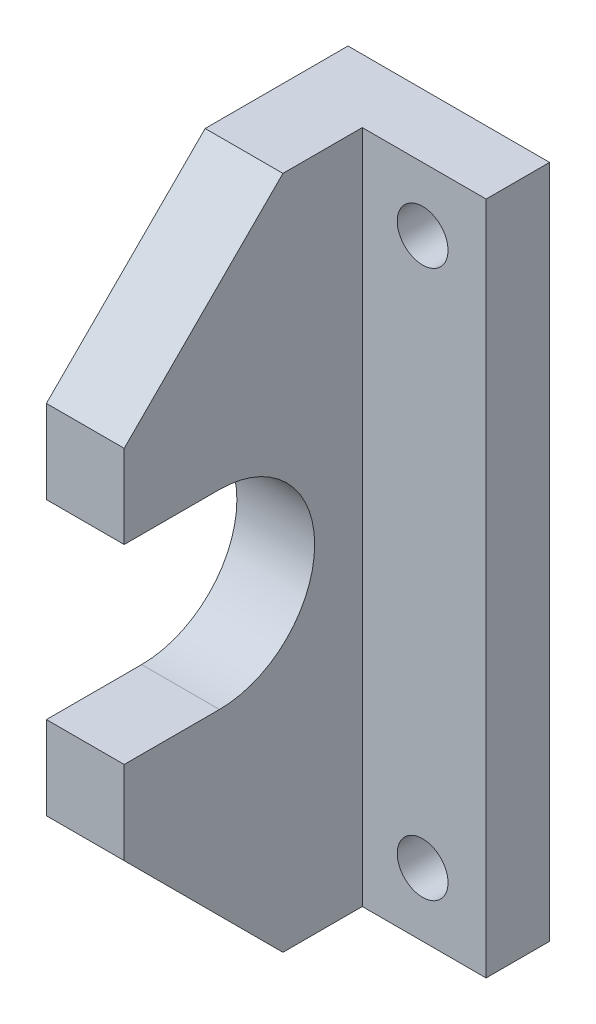
ISO-10303-21;
HEADER;
FILE_DESCRIPTION(('STEP AP214'),'2;1');
FILE_NAME('part.step','',(''),(''),'','','');
FILE_SCHEMA(('AUTOMOTIVE_DESIGN { 1 0 10303 214 1 1 1 1 }'));
ENDSEC;
DATA;
#1=APPLICATION_CONTEXT('core data for automotive mechanical design processes');
#2=APPLICATION_PROTOCOL_DEFINITION('international standard','automotive_design',2000,#1);
#3=PRODUCT_CONTEXT('',#1,'mechanical');
#4=PRODUCT('Part','Part','',(#3));
#5=PRODUCT_RELATED_PRODUCT_CATEGORY('part','',(#4));
#6=PRODUCT_DEFINITION_FORMATION('','',#4);
#7=PRODUCT_DEFINITION_CONTEXT('part definition',#1,'design');
#8=PRODUCT_DEFINITION('design','',#6,#7);
#9=PRODUCT_DEFINITION_SHAPE('','',#8);
#10=(LENGTH_UNIT() NAMED_UNIT(*) SI_UNIT(.MILLI.,.METRE.));
#11=(NAMED_UNIT(*) PLANE_ANGLE_UNIT() SI_UNIT($,.RADIAN.));
#12=(NAMED_UNIT(*) SI_UNIT($,.STERADIAN.) SOLID_ANGLE_UNIT());
#13=UNCERTAINTY_MEASURE_WITH_UNIT(LENGTH_MEASURE(1.E-05),#10,'distance_accuracy_value','');
#14=(GEOMETRIC_REPRESENTATION_CONTEXT(3) GLOBAL_UNCERTAINTY_ASSIGNED_CONTEXT((#13)) GLOBAL_UNIT_ASSIGNED_CONTEXT((#10,
#11,#12)) REPRESENTATION_CONTEXT('',''));
#15=CARTESIAN_POINT('',(0.,0.,0.));
#16=DIRECTION('',(0.,0.,1.));
#17=DIRECTION('',(1.,0.,0.));
#18=AXIS2_PLACEMENT_3D('',#15,#16,#17);
#19=CARTESIAN_POINT('',(0.,0.,19.));
#20=DIRECTION('',(0.,0.,1.));
#21=DIRECTION('',(1.,0.,0.));
#22=AXIS2_PLACEMENT_3D('',#19,#20,#21);
#23=PLANE('',#22);
#24=DIRECTION('',(0.,-1.,0.));
#25=VECTOR('',#24,1.);
#26=CARTESIAN_POINT('',(25.9154898415816,42.4999999977286,19.));
#27=LINE('',#26,#25);
#28=CARTESIAN_POINT('',(25.9154898415816,15.2500004309608,19.));
#29=VERTEX_POINT('',#28);
#30=CARTESIAN_POINT('',(25.9154898415816,9.99999999772865,19.));
#31=VERTEX_POINT('',#30);
#32=EDGE_CURVE('E169',#29,#31,#27,.T.);
#33=ORIENTED_EDGE('',*,*,#32,.T.);
#34=DIRECTION('',(1.,0.,0.));
#35=VECTOR('',#34,1.);
#36=CARTESIAN_POINT('',(30.8154898415816,9.99999999772864,19.));
#37=LINE('',#36,#35);
#38=CARTESIAN_POINT('',(30.8154898415816,9.99999999772866,19.));
#39=VERTEX_POINT('',#38);
#40=EDGE_CURVE('E45',#31,#39,#37,.T.);
#41=ORIENTED_EDGE('',*,*,#40,.T.);
#42=DIRECTION('',(0.,1.,0.));
#43=VECTOR('',#42,1.);
#44=CARTESIAN_POINT('',(30.8154898415816,42.4999999977286,19.));
#45=LINE('',#44,#43);
#46=CARTESIAN_POINT('',(30.8154898415816,15.2500004309608,19.));
#47=VERTEX_POINT('',#46);
#48=EDGE_CURVE('E170',#39,#47,#45,.T.);
#49=ORIENTED_EDGE('',*,*,#48,.T.);
#50=DIRECTION('',(1.,0.,0.));
#51=VECTOR('',#50,1.);
#52=CARTESIAN_POINT('',(25.9154898415816,15.2500004309608,19.));
#53=LINE('',#52,#51);
#54=EDGE_CURVE('E162',#29,#47,#53,.T.);
#55=ORIENTED_EDGE('',*,*,#54,.F.);
#56=EDGE_LOOP('',(#33,#41,#49,#55));
#57=FACE_BOUND('',#56,.T.);
#58=ADVANCED_FACE('F37',(#57),#23,.T.);
#59=CARTESIAN_POINT('',(0.,0.,4.));
#60=DIRECTION('',(0.,0.,-1.));
#61=DIRECTION('',(-1.,0.,0.));
#62=AXIS2_PLACEMENT_3D('',#59,#60,#61);
#63=PLANE('',#62);
#64=CARTESIAN_POINT('',(34.6154898415816,38.4999999977286,4.));
#65=DIRECTION('',(0.,0.,1.));
#66=DIRECTION('',(1.,0.,0.));
#67=AXIS2_PLACEMENT_3D('',#64,#65,#66);
#68=CIRCLE('',#67,1.6);
#69=CARTESIAN_POINT('',(36.2154898415816,38.4999999977286,4.));
#70=VERTEX_POINT('',#69);
#71=EDGE_CURVE('E175',#70,#70,#68,.T.);
#72=ORIENTED_EDGE('',*,*,#71,.F.);
#73=EDGE_LOOP('',(#72));
#74=FACE_BOUND('',#73,.T.);
#75=CARTESIAN_POINT('',(34.6154898415816,3.99999999772863,4.));
#76=DIRECTION('',(0.,0.,1.));
#77=DIRECTION('',(1.,0.,0.));
#78=AXIS2_PLACEMENT_3D('',#75,#76,#77);
#79=CIRCLE('',#78,1.6);
#80=CARTESIAN_POINT('',(36.2154898415816,3.99999999772863,4.));
#81=VERTEX_POINT('',#80);
#82=EDGE_CURVE('E242',#81,#81,#79,.T.);
#83=ORIENTED_EDGE('',*,*,#82,.F.);
#84=EDGE_LOOP('',(#83));
#85=FACE_BOUND('',#84,.T.);
#86=DIRECTION('',(0.,1.,0.));
#87=VECTOR('',#86,1.);
#88=CARTESIAN_POINT('',(30.8154898415816,42.4999999977286,4.));
#89=LINE('',#88,#87);
#90=CARTESIAN_POINT('',(30.8154898415816,-2.2713671249749E-09,4.));
#91=VERTEX_POINT('',#90);
#92=CARTESIAN_POINT('',(30.8154898415816,42.4999999977286,4.));
#93=VERTEX_POINT('',#92);
#94=EDGE_CURVE('E161',#91,#93,#89,.T.);
#95=ORIENTED_EDGE('',*,*,#94,.F.);
#96=DIRECTION('',(1.,0.,0.));
#97=VECTOR('',#96,1.);
#98=CARTESIAN_POINT('',(38.6154898415816,-2.2713671249749E-09,4.));
#99=LINE('',#98,#97);
#100=CARTESIAN_POINT('',(38.6154898415816,-2.2713671249749E-09,4.));
#101=VERTEX_POINT('',#100);
#102=EDGE_CURVE('E182',#91,#101,#99,.T.);
#103=ORIENTED_EDGE('',*,*,#102,.T.);
#104=DIRECTION('',(0.,1.,0.));
#105=VECTOR('',#104,1.);
#106=CARTESIAN_POINT('',(38.6154898415816,42.4999999977286,4.));
#107=LINE('',#106,#105);
#108=CARTESIAN_POINT('',(38.6154898415816,42.4999999977286,4.));
#109=VERTEX_POINT('',#108);
#110=EDGE_CURVE('E233',#101,#109,#107,.T.);
#111=ORIENTED_EDGE('',*,*,#110,.T.);
#112=DIRECTION('',(-1.,0.,0.));
#113=VECTOR('',#112,1.);
#114=CARTESIAN_POINT('',(38.6154898415816,42.4999999977286,4.));
#115=LINE('',#114,#113);
#116=EDGE_CURVE('E230',#109,#93,#115,.T.);
#117=ORIENTED_EDGE('',*,*,#116,.T.);
#118=EDGE_LOOP('',(#95,#103,#111,#117));
#119=FACE_BOUND('',#118,.T.);
#120=ADVANCED_FACE('F296',(#74,#85,#119),#63,.F.);
#121=CARTESIAN_POINT('',(0.,0.,0.));
#122=DIRECTION('',(0.,0.,-1.));
#123=DIRECTION('',(-1.,0.,0.));
#124=AXIS2_PLACEMENT_3D('',#121,#122,#123);
#125=PLANE('',#124);
#126=CARTESIAN_POINT('',(34.6154898415816,3.99999999772863,0.));
#127=DIRECTION('',(0.,0.,1.));
#128=DIRECTION('',(1.,0.,0.));
#129=AXIS2_PLACEMENT_3D('',#126,#127,#128);
#130=CIRCLE('',#129,1.6);
#131=CARTESIAN_POINT('',(36.2154898415816,3.99999999772863,0.));
#132=VERTEX_POINT('',#131);
#133=EDGE_CURVE('E272',#132,#132,#130,.T.);
#134=ORIENTED_EDGE('',*,*,#133,.T.);
#135=EDGE_LOOP('',(#134));
#136=FACE_BOUND('',#135,.T.);
#137=DIRECTION('',(0.,1.,0.));
#138=VECTOR('',#137,1.);
#139=CARTESIAN_POINT('',(38.6154898415816,42.4999999977286,0.));
#140=LINE('',#139,#138);
#141=CARTESIAN_POINT('',(38.6154898415816,-2.2713671249749E-09,0.));
#142=VERTEX_POINT('',#141);
#143=CARTESIAN_POINT('',(38.6154898415816,42.4999999977286,0.));
#144=VERTEX_POINT('',#143);
#145=EDGE_CURVE('E239',#142,#144,#140,.T.);
#146=ORIENTED_EDGE('',*,*,#145,.F.);
#147=DIRECTION('',(1.,0.,0.));
#148=VECTOR('',#147,1.);
#149=CARTESIAN_POINT('',(38.6154898415816,-2.2713671249749E-09,0.));
#150=LINE('',#149,#148);
#151=CARTESIAN_POINT('',(25.9154898415816,-2.2713671249749E-09,0.));
#152=VERTEX_POINT('',#151);
#153=EDGE_CURVE('E247',#152,#142,#150,.T.);
#154=ORIENTED_EDGE('',*,*,#153,.F.);
#155=DIRECTION('',(0.,-1.,0.));
#156=VECTOR('',#155,1.);
#157=CARTESIAN_POINT('',(25.9154898415816,42.4999999977286,0.));
#158=LINE('',#157,#156);
#159=CARTESIAN_POINT('',(25.9154898415816,42.4999999977286,0.));
#160=VERTEX_POINT('',#159);
#161=EDGE_CURVE('E244',#160,#152,#158,.T.);
#162=ORIENTED_EDGE('',*,*,#161,.F.);
#163=DIRECTION('',(-1.,0.,0.));
#164=VECTOR('',#163,1.);
#165=CARTESIAN_POINT('',(38.6154898415816,42.4999999977286,0.));
#166=LINE('',#165,#164);
#167=EDGE_CURVE('E241',#144,#160,#166,.T.);
#168=ORIENTED_EDGE('',*,*,#167,.F.);
#169=EDGE_LOOP('',(#146,#154,#162,#168));
#170=FACE_BOUND('',#169,.T.);
#171=CARTESIAN_POINT('',(34.6154898415816,38.4999999977286,0.));
#172=DIRECTION('',(0.,0.,1.));
#173=DIRECTION('',(1.,0.,0.));
#174=AXIS2_PLACEMENT_3D('',#171,#172,#173);
#175=CIRCLE('',#174,1.6);
#176=CARTESIAN_POINT('',(36.2154898415816,38.4999999977286,0.));
#177=VERTEX_POINT('',#176);
#178=EDGE_CURVE('E199',#177,#177,#175,.T.);
#179=ORIENTED_EDGE('',*,*,#178,.T.);
#180=EDGE_LOOP('',(#179));
#181=FACE_BOUND('',#180,.T.);
#182=ADVANCED_FACE('F261',(#136,#170,#181),#125,.T.);
#183=CARTESIAN_POINT('',(38.6154898415816,42.4999999977286,4.));
#184=DIRECTION('',(-1.,0.,0.));
#185=DIRECTION('',(0.,-1.,0.));
#186=AXIS2_PLACEMENT_3D('',#183,#184,#185);
#187=PLANE('',#186);
#188=ORIENTED_EDGE('',*,*,#145,.T.);
#189=DIRECTION('',(0.,0.,-1.));
#190=VECTOR('',#189,1.);
#191=CARTESIAN_POINT('',(38.6154898415816,42.4999999977286,4.));
#192=LINE('',#191,#190);
#193=EDGE_CURVE('E217',#109,#144,#192,.T.);
#194=ORIENTED_EDGE('',*,*,#193,.F.);
#195=ORIENTED_EDGE('',*,*,#110,.F.);
#196=DIRECTION('',(0.,0.,-1.));
#197=VECTOR('',#196,1.);
#198=CARTESIAN_POINT('',(38.6154898415816,-2.2713671249749E-09,4.));
#199=LINE('',#198,#197);
#200=EDGE_CURVE('E250',#101,#142,#199,.T.);
#201=ORIENTED_EDGE('',*,*,#200,.T.);
#202=EDGE_LOOP('',(#188,#194,#195,#201));
#203=FACE_BOUND('',#202,.T.);
#204=ADVANCED_FACE('F264',(#203),#187,.F.);
#205=CARTESIAN_POINT('',(38.6154898415816,42.4999999977286,4.));
#206=DIRECTION('',(0.,-1.,0.));
#207=DIRECTION('',(0.,0.,-1.));
#208=AXIS2_PLACEMENT_3D('',#205,#206,#207);
#209=PLANE('',#208);
#210=DIRECTION('',(0.,0.,-1.));
#211=VECTOR('',#210,1.);
#212=CARTESIAN_POINT('',(25.9154898415816,42.4999999977286,4.));
#213=LINE('',#212,#211);
#214=CARTESIAN_POINT('',(25.9154898415816,42.4999999977286,8.99999999999996));
#215=VERTEX_POINT('',#214);
#216=EDGE_CURVE('E222',#215,#160,#213,.T.);
#217=ORIENTED_EDGE('',*,*,#216,.F.);
#218=DIRECTION('',(1.,0.,0.));
#219=VECTOR('',#218,1.);
#220=CARTESIAN_POINT('',(30.8154898415816,42.4999999977286,8.99999999999996));
#221=LINE('',#220,#219);
#222=CARTESIAN_POINT('',(30.8154898415816,42.4999999977286,8.99999999999996));
#223=VERTEX_POINT('',#222);
#224=EDGE_CURVE('E195',#215,#223,#221,.T.);
#225=ORIENTED_EDGE('',*,*,#224,.T.);
#226=DIRECTION('',(0.,0.,-1.));
#227=VECTOR('',#226,1.);
#228=CARTESIAN_POINT('',(30.8154898415816,42.4999999977286,19.));
#229=LINE('',#228,#227);
#230=EDGE_CURVE('E172',#223,#93,#229,.T.);
#231=ORIENTED_EDGE('',*,*,#230,.T.);
#232=ORIENTED_EDGE('',*,*,#116,.F.);
#233=ORIENTED_EDGE('',*,*,#193,.T.);
#234=ORIENTED_EDGE('',*,*,#167,.T.);
#235=EDGE_LOOP('',(#217,#225,#231,#232,#233,#234));
#236=FACE_BOUND('',#235,.T.);
#237=ADVANCED_FACE('F313',(#236),#209,.F.);
#238=CARTESIAN_POINT('',(25.9154898415816,42.4999999977286,4.));
#239=DIRECTION('',(1.,0.,0.));
#240=DIRECTION('',(0.,1.,0.));
#241=AXIS2_PLACEMENT_3D('',#238,#239,#240);
#242=PLANE('',#241);
#243=CARTESIAN_POINT('',(25.9154898415816,32.4999999977286,19.));
#244=VERTEX_POINT('',#243);
#245=CARTESIAN_POINT('',(25.9154898415816,27.2500004309608,19.));
#246=VERTEX_POINT('',#245);
#247=EDGE_CURVE('E166',#244,#246,#27,.T.);
#248=ORIENTED_EDGE('',*,*,#247,.F.);
#249=DIRECTION('',(0.,0.707106781186546,-0.707106781186549));
#250=VECTOR('',#249,1.);
#251=CARTESIAN_POINT('',(25.9154898415816,32.4999999977286,19.));
#252=LINE('',#251,#250);
#253=EDGE_CURVE('E193',#244,#215,#252,.T.);
#254=ORIENTED_EDGE('',*,*,#253,.T.);
#255=ORIENTED_EDGE('',*,*,#216,.T.);
#256=ORIENTED_EDGE('',*,*,#161,.T.);
#257=DIRECTION('',(0.,0.,-1.));
#258=VECTOR('',#257,1.);
#259=CARTESIAN_POINT('',(25.9154898415816,-2.2713671249749E-09,4.));
#260=LINE('',#259,#258);
#261=CARTESIAN_POINT('',(25.9154898415816,-2.27136885829299E-09,8.99999999999995));
#262=VERTEX_POINT('',#261);
#263=EDGE_CURVE('E214',#262,#152,#260,.T.);
#264=ORIENTED_EDGE('',*,*,#263,.F.);
#265=DIRECTION('',(0.,0.707106781186546,0.707106781186549));
#266=VECTOR('',#265,1.);
#267=CARTESIAN_POINT('',(25.9154898415816,9.99999999772864,19.));
#268=LINE('',#267,#266);
#269=EDGE_CURVE('E212',#262,#31,#268,.T.);
#270=ORIENTED_EDGE('',*,*,#269,.T.);
#271=ORIENTED_EDGE('',*,*,#32,.F.);
#272=DIRECTION('',(0.,0.,-1.));
#273=VECTOR('',#272,1.);
#274=CARTESIAN_POINT('',(25.9154898415816,15.2500004309608,19.));
#275=LINE('',#274,#273);
#276=CARTESIAN_POINT('',(25.9154898415816,15.2500004309608,13.));
#277=VERTEX_POINT('',#276);
#278=EDGE_CURVE('E138',#29,#277,#275,.T.);
#279=ORIENTED_EDGE('',*,*,#278,.T.);
#280=CARTESIAN_POINT('',(25.9154898415816,21.2500004309608,13.));
#281=DIRECTION('',(1.,0.,0.));
#282=DIRECTION('',(0.,1.,0.));
#283=AXIS2_PLACEMENT_3D('',#280,#281,#282);
#284=CIRCLE('',#283,6.);
#285=CARTESIAN_POINT('',(25.9154898415816,27.2500004309608,13.));
#286=VERTEX_POINT('',#285);
#287=EDGE_CURVE('E131',#277,#286,#284,.T.);
#288=ORIENTED_EDGE('',*,*,#287,.T.);
#289=DIRECTION('',(0.,0.,1.));
#290=VECTOR('',#289,1.);
#291=CARTESIAN_POINT('',(25.9154898415816,27.2500004309608,13.));
#292=LINE('',#291,#290);
#293=EDGE_CURVE('E142',#286,#246,#292,.T.);
#294=ORIENTED_EDGE('',*,*,#293,.T.);
#295=EDGE_LOOP('',(#248,#254,#255,#256,#264,#270,#271,#279,#288,#294));
#296=FACE_BOUND('',#295,.T.);
#297=ADVANCED_FACE('F148',(#296),#242,.F.);
#298=CARTESIAN_POINT('',(38.6154898415816,-2.2713671249749E-09,4.));
#299=DIRECTION('',(0.,1.,0.));
#300=DIRECTION('',(0.,0.,1.));
#301=AXIS2_PLACEMENT_3D('',#298,#299,#300);
#302=PLANE('',#301);
#303=DIRECTION('',(0.,0.,-1.));
#304=VECTOR('',#303,1.);
#305=CARTESIAN_POINT('',(30.8154898415816,-2.2713671249749E-09,19.));
#306=LINE('',#305,#304);
#307=CARTESIAN_POINT('',(30.8154898415816,-2.2713671249749E-09,8.99999999999996));
#308=VERTEX_POINT('',#307);
#309=EDGE_CURVE('E192',#308,#91,#306,.T.);
#310=ORIENTED_EDGE('',*,*,#309,.F.);
#311=DIRECTION('',(-1.,0.,0.));
#312=VECTOR('',#311,1.);
#313=CARTESIAN_POINT('',(25.9154898415816,-2.2713671249749E-09,8.99999999999996));
#314=LINE('',#313,#312);
#315=EDGE_CURVE('E11',#308,#262,#314,.T.);
#316=ORIENTED_EDGE('',*,*,#315,.T.);
#317=ORIENTED_EDGE('',*,*,#263,.T.);
#318=ORIENTED_EDGE('',*,*,#153,.T.);
#319=ORIENTED_EDGE('',*,*,#200,.F.);
#320=ORIENTED_EDGE('',*,*,#102,.F.);
#321=EDGE_LOOP('',(#310,#316,#317,#318,#319,#320));
#322=FACE_BOUND('',#321,.T.);
#323=ADVANCED_FACE('F254',(#322),#302,.F.);
#324=CARTESIAN_POINT('',(34.6154898415816,3.99999999772863,4.));
#325=DIRECTION('',(0.,0.,-1.));
#326=DIRECTION('',(-1.,0.,0.));
#327=AXIS2_PLACEMENT_3D('',#324,#325,#326);
#328=CYLINDRICAL_SURFACE('',#327,1.6);
#329=ORIENTED_EDGE('',*,*,#82,.T.);
#330=EDGE_LOOP('',(#329));
#331=FACE_BOUND('',#330,.T.);
#332=ORIENTED_EDGE('',*,*,#133,.F.);
#333=EDGE_LOOP('',(#332));
#334=FACE_BOUND('',#333,.T.);
#335=ADVANCED_FACE('F284',(#331,#334),#328,.F.);
#336=CARTESIAN_POINT('',(34.6154898415816,38.4999999977286,4.));
#337=DIRECTION('',(0.,0.,-1.));
#338=DIRECTION('',(-1.,0.,0.));
#339=AXIS2_PLACEMENT_3D('',#336,#337,#338);
#340=CYLINDRICAL_SURFACE('',#339,1.6);
#341=ORIENTED_EDGE('',*,*,#71,.T.);
#342=EDGE_LOOP('',(#341));
#343=FACE_BOUND('',#342,.T.);
#344=ORIENTED_EDGE('',*,*,#178,.F.);
#345=EDGE_LOOP('',(#344));
#346=FACE_BOUND('',#345,.T.);
#347=ADVANCED_FACE('F282',(#343,#346),#340,.F.);
#348=CARTESIAN_POINT('',(30.8154898415816,42.4999999977286,19.));
#349=DIRECTION('',(-1.,0.,0.));
#350=DIRECTION('',(0.,-1.,0.));
#351=AXIS2_PLACEMENT_3D('',#348,#349,#350);
#352=PLANE('',#351);
#353=ORIENTED_EDGE('',*,*,#230,.F.);
#354=DIRECTION('',(0.,-0.707106781186546,0.707106781186549));
#355=VECTOR('',#354,1.);
#356=CARTESIAN_POINT('',(30.8154898415816,32.4999999977286,19.));
#357=LINE('',#356,#355);
#358=CARTESIAN_POINT('',(30.8154898415816,32.4999999977286,19.));
#359=VERTEX_POINT('',#358);
#360=EDGE_CURVE('E201',#223,#359,#357,.T.);
#361=ORIENTED_EDGE('',*,*,#360,.T.);
#362=CARTESIAN_POINT('',(30.8154898415816,27.2500004309608,19.));
#363=VERTEX_POINT('',#362);
#364=EDGE_CURVE('E168',#363,#359,#45,.T.);
#365=ORIENTED_EDGE('',*,*,#364,.F.);
#366=DIRECTION('',(0.,0.,1.));
#367=VECTOR('',#366,1.);
#368=CARTESIAN_POINT('',(30.8154898415816,27.2500004309608,13.));
#369=LINE('',#368,#367);
#370=CARTESIAN_POINT('',(30.8154898415816,27.2500004309608,13.));
#371=VERTEX_POINT('',#370);
#372=EDGE_CURVE('E153',#371,#363,#369,.T.);
#373=ORIENTED_EDGE('',*,*,#372,.F.);
#374=CARTESIAN_POINT('',(30.8154898415816,21.2500004309608,13.));
#375=DIRECTION('',(1.,0.,0.));
#376=DIRECTION('',(0.,1.,0.));
#377=AXIS2_PLACEMENT_3D('',#374,#375,#376);
#378=CIRCLE('',#377,6.);
#379=CARTESIAN_POINT('',(30.8154898415816,15.2500004309608,13.));
#380=VERTEX_POINT('',#379);
#381=EDGE_CURVE('E134',#380,#371,#378,.T.);
#382=ORIENTED_EDGE('',*,*,#381,.F.);
#383=DIRECTION('',(0.,0.,-1.));
#384=VECTOR('',#383,1.);
#385=CARTESIAN_POINT('',(30.8154898415816,15.2500004309608,19.));
#386=LINE('',#385,#384);
#387=EDGE_CURVE('E150',#47,#380,#386,.T.);
#388=ORIENTED_EDGE('',*,*,#387,.F.);
#389=ORIENTED_EDGE('',*,*,#48,.F.);
#390=DIRECTION('',(0.,-0.707106781186546,-0.707106781186549));
#391=VECTOR('',#390,1.);
#392=CARTESIAN_POINT('',(30.8154898415816,9.99999999772864,19.));
#393=LINE('',#392,#391);
#394=EDGE_CURVE('E52',#39,#308,#393,.T.);
#395=ORIENTED_EDGE('',*,*,#394,.T.);
#396=ORIENTED_EDGE('',*,*,#309,.T.);
#397=ORIENTED_EDGE('',*,*,#94,.T.);
#398=EDGE_LOOP('',(#353,#361,#365,#373,#382,#388,#389,#395,#396,#397));
#399=FACE_BOUND('',#398,.T.);
#400=ADVANCED_FACE('F208',(#399),#352,.F.);
#401=ORIENTED_EDGE('',*,*,#364,.T.);
#402=DIRECTION('',(-1.,0.,0.));
#403=VECTOR('',#402,1.);
#404=CARTESIAN_POINT('',(25.9154898415816,32.4999999977286,19.));
#405=LINE('',#404,#403);
#406=EDGE_CURVE('E215',#359,#244,#405,.T.);
#407=ORIENTED_EDGE('',*,*,#406,.T.);
#408=ORIENTED_EDGE('',*,*,#247,.T.);
#409=DIRECTION('',(1.,0.,0.));
#410=VECTOR('',#409,1.);
#411=CARTESIAN_POINT('',(25.9154898415816,27.2500004309608,19.));
#412=LINE('',#411,#410);
#413=EDGE_CURVE('E137',#246,#363,#412,.T.);
#414=ORIENTED_EDGE('',*,*,#413,.T.);
#415=EDGE_LOOP('',(#401,#407,#408,#414));
#416=FACE_BOUND('',#415,.T.);
#417=ADVANCED_FACE('F291',(#416),#23,.T.);
#418=CARTESIAN_POINT('',(25.9154898415816,21.2500004309608,13.));
#419=DIRECTION('',(1.,0.,0.));
#420=DIRECTION('',(0.,1.,0.));
#421=AXIS2_PLACEMENT_3D('',#418,#419,#420);
#422=CYLINDRICAL_SURFACE('',#421,6.);
#423=ORIENTED_EDGE('',*,*,#381,.T.);
#424=DIRECTION('',(1.,0.,0.));
#425=VECTOR('',#424,1.);
#426=CARTESIAN_POINT('',(25.9154898415816,27.2500004309608,13.));
#427=LINE('',#426,#425);
#428=EDGE_CURVE('E127',#286,#371,#427,.T.);
#429=ORIENTED_EDGE('',*,*,#428,.F.);
#430=ORIENTED_EDGE('',*,*,#287,.F.);
#431=DIRECTION('',(1.,0.,0.));
#432=VECTOR('',#431,1.);
#433=CARTESIAN_POINT('',(25.9154898415816,15.2500004309608,13.));
#434=LINE('',#433,#432);
#435=EDGE_CURVE('E159',#277,#380,#434,.T.);
#436=ORIENTED_EDGE('',*,*,#435,.T.);
#437=EDGE_LOOP('',(#423,#429,#430,#436));
#438=FACE_BOUND('',#437,.T.);
#439=ADVANCED_FACE('F129',(#438),#422,.F.);
#440=CARTESIAN_POINT('',(25.9154898415816,15.2500004309608,19.));
#441=DIRECTION('',(0.,-1.,0.));
#442=DIRECTION('',(0.,0.,-1.));
#443=AXIS2_PLACEMENT_3D('',#440,#441,#442);
#444=PLANE('',#443);
#445=ORIENTED_EDGE('',*,*,#387,.T.);
#446=ORIENTED_EDGE('',*,*,#435,.F.);
#447=ORIENTED_EDGE('',*,*,#278,.F.);
#448=ORIENTED_EDGE('',*,*,#54,.T.);
#449=EDGE_LOOP('',(#445,#446,#447,#448));
#450=FACE_BOUND('',#449,.T.);
#451=ADVANCED_FACE('F210',(#450),#444,.F.);
#452=CARTESIAN_POINT('',(25.9154898415816,27.2500004309608,13.));
#453=DIRECTION('',(0.,1.,0.));
#454=DIRECTION('',(-1.,0.,0.));
#455=AXIS2_PLACEMENT_3D('',#452,#453,#454);
#456=PLANE('',#455);
#457=ORIENTED_EDGE('',*,*,#372,.T.);
#458=ORIENTED_EDGE('',*,*,#413,.F.);
#459=ORIENTED_EDGE('',*,*,#293,.F.);
#460=ORIENTED_EDGE('',*,*,#428,.T.);
#461=EDGE_LOOP('',(#457,#458,#459,#460));
#462=FACE_BOUND('',#461,.T.);
#463=ADVANCED_FACE('F143',(#462),#456,.F.);
#464=CARTESIAN_POINT('',(0.,32.4999999977286,19.));
#465=DIRECTION('',(0.,0.707106781186549,0.707106781186546));
#466=DIRECTION('',(1.,0.,0.));
#467=AXIS2_PLACEMENT_3D('',#464,#465,#466);
#468=PLANE('',#467);
#469=ORIENTED_EDGE('',*,*,#360,.F.);
#470=ORIENTED_EDGE('',*,*,#224,.F.);
#471=ORIENTED_EDGE('',*,*,#253,.F.);
#472=ORIENTED_EDGE('',*,*,#406,.F.);
#473=EDGE_LOOP('',(#469,#470,#471,#472));
#474=FACE_BOUND('',#473,.T.);
#475=ADVANCED_FACE('F311',(#474),#468,.T.);
#476=CARTESIAN_POINT('',(0.,9.99999999772864,19.));
#477=DIRECTION('',(0.,-0.707106781186549,0.707106781186546));
#478=DIRECTION('',(-1.,0.,0.));
#479=AXIS2_PLACEMENT_3D('',#476,#477,#478);
#480=PLANE('',#479);
#481=ORIENTED_EDGE('',*,*,#269,.F.);
#482=ORIENTED_EDGE('',*,*,#315,.F.);
#483=ORIENTED_EDGE('',*,*,#394,.F.);
#484=ORIENTED_EDGE('',*,*,#40,.F.);
#485=EDGE_LOOP('',(#481,#482,#483,#484));
#486=FACE_BOUND('',#485,.T.);
#487=ADVANCED_FACE('F39',(#486),#480,.T.);
#488=CLOSED_SHELL('',(#58,#120,#182,#204,#237,#297,#323,#335,#347,#400,#417,#439,#451,#463,#475,#487));
#489=MANIFOLD_SOLID_BREP('B2',#488);
#490=ADVANCED_BREP_SHAPE_REPRESENTATION('',(#18,#489),#14);
#491=SHAPE_DEFINITION_REPRESENTATION(#9,#490);
ENDSEC;
END-ISO-10303-21;
